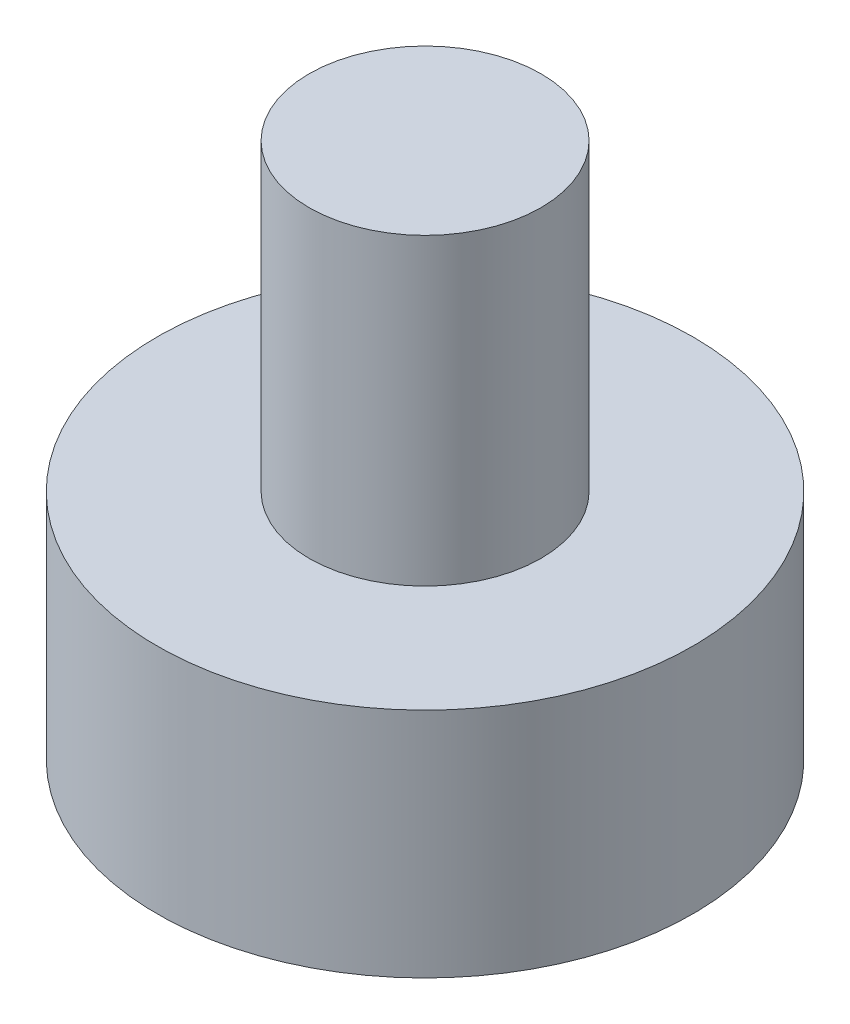
ISO-10303-21;
HEADER;
FILE_DESCRIPTION(('STEP AP214'),'2;1');
FILE_NAME('part.step','',(''),(''),'','','');
FILE_SCHEMA(('AUTOMOTIVE_DESIGN { 1 0 10303 214 1 1 1 1 }'));
ENDSEC;
DATA;
#1=APPLICATION_CONTEXT('core data for automotive mechanical design processes');
#2=APPLICATION_PROTOCOL_DEFINITION('international standard','automotive_design',2000,#1);
#3=PRODUCT_CONTEXT('',#1,'mechanical');
#4=PRODUCT('Part','Part','',(#3));
#5=PRODUCT_RELATED_PRODUCT_CATEGORY('part','',(#4));
#6=PRODUCT_DEFINITION_FORMATION('','',#4);
#7=PRODUCT_DEFINITION_CONTEXT('part definition',#1,'design');
#8=PRODUCT_DEFINITION('design','',#6,#7);
#9=PRODUCT_DEFINITION_SHAPE('','',#8);
#10=(LENGTH_UNIT() NAMED_UNIT(*) SI_UNIT(.MILLI.,.METRE.));
#11=(NAMED_UNIT(*) PLANE_ANGLE_UNIT() SI_UNIT($,.RADIAN.));
#12=(NAMED_UNIT(*) SI_UNIT($,.STERADIAN.) SOLID_ANGLE_UNIT());
#13=UNCERTAINTY_MEASURE_WITH_UNIT(LENGTH_MEASURE(1.E-05),#10,'distance_accuracy_value','');
#14=(GEOMETRIC_REPRESENTATION_CONTEXT(3) GLOBAL_UNCERTAINTY_ASSIGNED_CONTEXT((#13)) GLOBAL_UNIT_ASSIGNED_CONTEXT((#10,
#11,#12)) REPRESENTATION_CONTEXT('',''));
#15=CARTESIAN_POINT('',(0.,0.,0.));
#16=DIRECTION('',(0.,0.,1.));
#17=DIRECTION('',(1.,0.,0.));
#18=AXIS2_PLACEMENT_3D('',#15,#16,#17);
#19=CARTESIAN_POINT('',(0.,55.,0.));
#20=DIRECTION('',(0.,-1.,0.));
#21=DIRECTION('',(0.,0.,-1.));
#22=AXIS2_PLACEMENT_3D('',#19,#20,#21);
#23=CYLINDRICAL_SURFACE('',#22,21.);
#24=CARTESIAN_POINT('',(0.,55.,0.));
#25=DIRECTION('',(0.,1.,0.));
#26=DIRECTION('',(0.,0.,1.));
#27=AXIS2_PLACEMENT_3D('',#24,#25,#26);
#28=CIRCLE('',#27,21.);
#29=CARTESIAN_POINT('',(0.,55.,21.));
#30=VERTEX_POINT('',#29);
#31=EDGE_CURVE('E10',#30,#30,#28,.T.);
#32=ORIENTED_EDGE('',*,*,#31,.F.);
#33=EDGE_LOOP('',(#32));
#34=FACE_BOUND('',#33,.T.);
#35=CARTESIAN_POINT('',(0.,0.,0.));
#36=DIRECTION('',(0.,1.,0.));
#37=DIRECTION('',(0.,0.,1.));
#38=AXIS2_PLACEMENT_3D('',#35,#36,#37);
#39=CIRCLE('',#38,21.);
#40=CARTESIAN_POINT('',(0.,0.,21.));
#41=VERTEX_POINT('',#40);
#42=EDGE_CURVE('E35',#41,#41,#39,.T.);
#43=ORIENTED_EDGE('',*,*,#42,.T.);
#44=EDGE_LOOP('',(#43));
#45=FACE_BOUND('',#44,.T.);
#46=ADVANCED_FACE('F32',(#34,#45),#23,.T.);
#47=CARTESIAN_POINT('',(0.,55.,0.));
#48=DIRECTION('',(0.,1.,0.));
#49=DIRECTION('',(0.,0.,1.));
#50=AXIS2_PLACEMENT_3D('',#47,#48,#49);
#51=PLANE('',#50);
#52=ORIENTED_EDGE('',*,*,#31,.T.);
#53=EDGE_LOOP('',(#52));
#54=FACE_BOUND('',#53,.T.);
#55=ADVANCED_FACE('F55',(#54),#51,.T.);
#56=CARTESIAN_POINT('',(0.,-42.,0.));
#57=DIRECTION('',(0.,1.,0.));
#58=DIRECTION('',(0.,0.,1.));
#59=AXIS2_PLACEMENT_3D('',#56,#57,#58);
#60=CYLINDRICAL_SURFACE('',#59,48.5);
#61=CARTESIAN_POINT('',(0.,-42.,0.));
#62=DIRECTION('',(0.,-1.,0.));
#63=DIRECTION('',(0.,0.,-1.));
#64=AXIS2_PLACEMENT_3D('',#61,#62,#63);
#65=CIRCLE('',#64,48.5);
#66=CARTESIAN_POINT('',(0.,-42.,-48.5));
#67=VERTEX_POINT('',#66);
#68=EDGE_CURVE('E42',#67,#67,#65,.T.);
#69=ORIENTED_EDGE('',*,*,#68,.F.);
#70=EDGE_LOOP('',(#69));
#71=FACE_BOUND('',#70,.T.);
#72=CARTESIAN_POINT('',(0.,0.,0.));
#73=DIRECTION('',(0.,-1.,0.));
#74=DIRECTION('',(0.,0.,-1.));
#75=AXIS2_PLACEMENT_3D('',#72,#73,#74);
#76=CIRCLE('',#75,48.5);
#77=CARTESIAN_POINT('',(0.,0.,-48.5));
#78=VERTEX_POINT('',#77);
#79=EDGE_CURVE('E44',#78,#78,#76,.T.);
#80=ORIENTED_EDGE('',*,*,#79,.T.);
#81=EDGE_LOOP('',(#80));
#82=FACE_BOUND('',#81,.T.);
#83=ADVANCED_FACE('F52',(#71,#82),#60,.T.);
#84=CARTESIAN_POINT('',(0.,-42.,0.));
#85=DIRECTION('',(0.,-1.,0.));
#86=DIRECTION('',(0.,0.,-1.));
#87=AXIS2_PLACEMENT_3D('',#84,#85,#86);
#88=PLANE('',#87);
#89=ORIENTED_EDGE('',*,*,#68,.T.);
#90=EDGE_LOOP('',(#89));
#91=FACE_BOUND('',#90,.T.);
#92=ADVANCED_FACE('F50',(#91),#88,.T.);
#93=CARTESIAN_POINT('',(0.,0.,0.));
#94=DIRECTION('',(0.,-1.,0.));
#95=DIRECTION('',(0.,0.,-1.));
#96=AXIS2_PLACEMENT_3D('',#93,#94,#95);
#97=PLANE('',#96);
#98=ORIENTED_EDGE('',*,*,#42,.F.);
#99=EDGE_LOOP('',(#98));
#100=FACE_BOUND('',#99,.T.);
#101=ORIENTED_EDGE('',*,*,#79,.F.);
#102=EDGE_LOOP('',(#101));
#103=FACE_BOUND('',#102,.T.);
#104=ADVANCED_FACE('F59',(#100,#103),#97,.F.);
#105=CLOSED_SHELL('',(#46,#55,#83,#92,#104));
#106=MANIFOLD_SOLID_BREP('B2',#105);
#107=ADVANCED_BREP_SHAPE_REPRESENTATION('',(#18,#106),#14);
#108=SHAPE_DEFINITION_REPRESENTATION(#9,#107);
ENDSEC;
END-ISO-10303-21;
